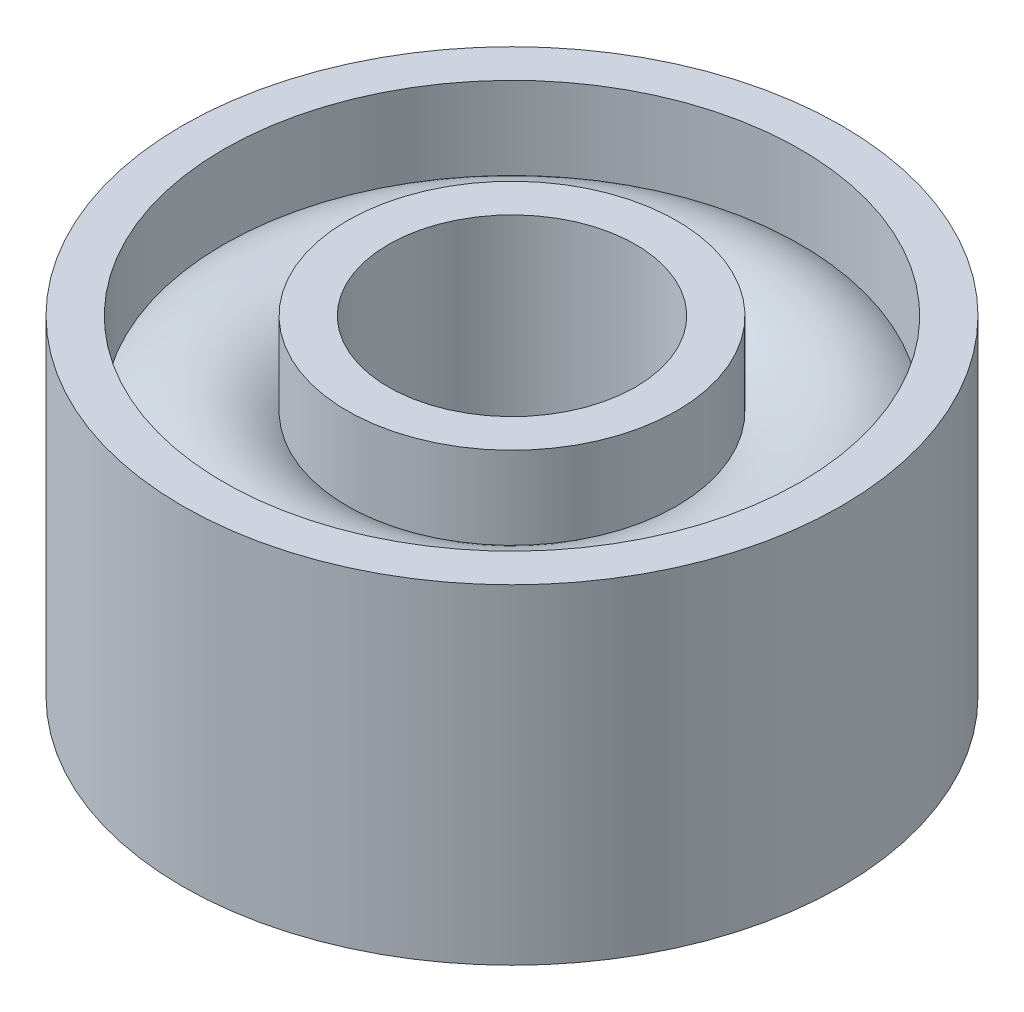
ISO-10303-21;
HEADER;
FILE_DESCRIPTION(('STEP AP214'),'2;1');
FILE_NAME('part.step','',(''),(''),'','','');
FILE_SCHEMA(('AUTOMOTIVE_DESIGN { 1 0 10303 214 1 1 1 1 }'));
ENDSEC;
DATA;
#1=APPLICATION_CONTEXT('core data for automotive mechanical design processes');
#2=APPLICATION_PROTOCOL_DEFINITION('international standard','automotive_design',2000,#1);
#3=PRODUCT_CONTEXT('',#1,'mechanical');
#4=PRODUCT('Part','Part','',(#3));
#5=PRODUCT_RELATED_PRODUCT_CATEGORY('part','',(#4));
#6=PRODUCT_DEFINITION_FORMATION('','',#4);
#7=PRODUCT_DEFINITION_CONTEXT('part definition',#1,'design');
#8=PRODUCT_DEFINITION('design','',#6,#7);
#9=PRODUCT_DEFINITION_SHAPE('','',#8);
#10=(LENGTH_UNIT() NAMED_UNIT(*) SI_UNIT(.MILLI.,.METRE.));
#11=(NAMED_UNIT(*) PLANE_ANGLE_UNIT() SI_UNIT($,.RADIAN.));
#12=(NAMED_UNIT(*) SI_UNIT($,.STERADIAN.) SOLID_ANGLE_UNIT());
#13=UNCERTAINTY_MEASURE_WITH_UNIT(LENGTH_MEASURE(1.E-05),#10,'distance_accuracy_value','');
#14=(GEOMETRIC_REPRESENTATION_CONTEXT(3) GLOBAL_UNCERTAINTY_ASSIGNED_CONTEXT((#13)) GLOBAL_UNIT_ASSIGNED_CONTEXT((#10,
#11,#12)) REPRESENTATION_CONTEXT('',''));
#15=CARTESIAN_POINT('',(0.,0.,0.));
#16=DIRECTION('',(0.,0.,1.));
#17=DIRECTION('',(1.,0.,0.));
#18=AXIS2_PLACEMENT_3D('',#15,#16,#17);
#19=CARTESIAN_POINT('',(1.5,2.,0.));
#20=DIRECTION('',(0.,-1.,0.));
#21=DIRECTION('',(1.,0.,0.));
#22=AXIS2_PLACEMENT_3D('',#19,#20,#21);
#23=PLANE('',#22);
#24=CARTESIAN_POINT('',(0.,2.,0.));
#25=DIRECTION('',(0.,1.,0.));
#26=DIRECTION('',(-1.,0.,0.));
#27=AXIS2_PLACEMENT_3D('',#24,#25,#26);
#28=CIRCLE('',#27,1.5);
#29=CARTESIAN_POINT('',(-1.5,2.,0.));
#30=VERTEX_POINT('',#29);
#31=EDGE_CURVE('E94',#30,#30,#28,.T.);
#32=ORIENTED_EDGE('',*,*,#31,.F.);
#33=EDGE_LOOP('',(#32));
#34=FACE_BOUND('',#33,.T.);
#35=CARTESIAN_POINT('',(0.,2.,0.));
#36=DIRECTION('',(0.,1.,0.));
#37=DIRECTION('',(-1.,0.,0.));
#38=AXIS2_PLACEMENT_3D('',#35,#36,#37);
#39=CIRCLE('',#38,2.);
#40=CARTESIAN_POINT('',(-2.,2.,0.));
#41=VERTEX_POINT('',#40);
#42=EDGE_CURVE('E10',#41,#41,#39,.T.);
#43=ORIENTED_EDGE('',*,*,#42,.T.);
#44=EDGE_LOOP('',(#43));
#45=FACE_BOUND('',#44,.T.);
#46=ADVANCED_FACE('F43',(#34,#45),#23,.F.);
#47=CARTESIAN_POINT('',(0.,1.33821248436376,0.));
#48=DIRECTION('',(0.,1.,0.));
#49=DIRECTION('',(-1.,0.,0.));
#50=AXIS2_PLACEMENT_3D('',#47,#48,#49);
#51=CYLINDRICAL_SURFACE('',#50,2.);
#52=ORIENTED_EDGE('',*,*,#42,.F.);
#53=EDGE_LOOP('',(#52));
#54=FACE_BOUND('',#53,.T.);
#55=CARTESIAN_POINT('',(0.,1.,0.));
#56=DIRECTION('',(0.,1.,0.));
#57=DIRECTION('',(-1.,0.,0.));
#58=AXIS2_PLACEMENT_3D('',#55,#56,#57);
#59=CIRCLE('',#58,2.);
#60=CARTESIAN_POINT('',(-2.,0.999999999999999,0.));
#61=VERTEX_POINT('',#60);
#62=EDGE_CURVE('E50',#61,#61,#59,.T.);
#63=ORIENTED_EDGE('',*,*,#62,.T.);
#64=EDGE_LOOP('',(#63));
#65=FACE_BOUND('',#64,.T.);
#66=ADVANCED_FACE('F102',(#54,#65),#51,.T.);
#67=CARTESIAN_POINT('',(0.,0.,0.));
#68=DIRECTION('',(0.,1.,0.));
#69=DIRECTION('',(-1.,0.,0.));
#70=AXIS2_PLACEMENT_3D('',#67,#68,#69);
#71=TOROIDAL_SURFACE('',#70,2.75,1.25);
#72=ORIENTED_EDGE('',*,*,#62,.F.);
#73=EDGE_LOOP('',(#72));
#74=FACE_BOUND('',#73,.T.);
#75=CARTESIAN_POINT('',(0.,0.999999999999999,0.));
#76=DIRECTION('',(0.,1.,0.));
#77=DIRECTION('',(-1.,0.,0.));
#78=AXIS2_PLACEMENT_3D('',#75,#76,#77);
#79=CIRCLE('',#78,3.5);
#80=CARTESIAN_POINT('',(-3.5,0.999999999999999,0.));
#81=VERTEX_POINT('',#80);
#82=EDGE_CURVE('E55',#81,#81,#79,.T.);
#83=ORIENTED_EDGE('',*,*,#82,.T.);
#84=EDGE_LOOP('',(#83));
#85=FACE_BOUND('',#84,.T.);
#86=ADVANCED_FACE('F106',(#74,#85),#71,.T.);
#87=CARTESIAN_POINT('',(0.,1.33821248436376,0.));
#88=DIRECTION('',(0.,1.,0.));
#89=DIRECTION('',(-1.,0.,0.));
#90=AXIS2_PLACEMENT_3D('',#87,#88,#89);
#91=CYLINDRICAL_SURFACE('',#90,3.5);
#92=ORIENTED_EDGE('',*,*,#82,.F.);
#93=EDGE_LOOP('',(#92));
#94=FACE_BOUND('',#93,.T.);
#95=CARTESIAN_POINT('',(0.,2.,0.));
#96=DIRECTION('',(0.,1.,0.));
#97=DIRECTION('',(-1.,0.,0.));
#98=AXIS2_PLACEMENT_3D('',#95,#96,#97);
#99=CIRCLE('',#98,3.5);
#100=CARTESIAN_POINT('',(-3.5,2.,0.));
#101=VERTEX_POINT('',#100);
#102=EDGE_CURVE('E60',#101,#101,#99,.T.);
#103=ORIENTED_EDGE('',*,*,#102,.T.);
#104=EDGE_LOOP('',(#103));
#105=FACE_BOUND('',#104,.T.);
#106=ADVANCED_FACE('F111',(#94,#105),#91,.F.);
#107=CARTESIAN_POINT('',(3.5,2.,0.));
#108=DIRECTION('',(0.,-1.,0.));
#109=DIRECTION('',(1.,0.,0.));
#110=AXIS2_PLACEMENT_3D('',#107,#108,#109);
#111=PLANE('',#110);
#112=ORIENTED_EDGE('',*,*,#102,.F.);
#113=EDGE_LOOP('',(#112));
#114=FACE_BOUND('',#113,.T.);
#115=CARTESIAN_POINT('',(0.,2.,0.));
#116=DIRECTION('',(0.,1.,0.));
#117=DIRECTION('',(-1.,0.,0.));
#118=AXIS2_PLACEMENT_3D('',#115,#116,#117);
#119=CIRCLE('',#118,4.);
#120=CARTESIAN_POINT('',(-4.,2.,0.));
#121=VERTEX_POINT('',#120);
#122=EDGE_CURVE('E66',#121,#121,#119,.T.);
#123=ORIENTED_EDGE('',*,*,#122,.T.);
#124=EDGE_LOOP('',(#123));
#125=FACE_BOUND('',#124,.T.);
#126=ADVANCED_FACE('F117',(#114,#125),#111,.F.);
#127=CARTESIAN_POINT('',(0.,1.33821248436376,0.));
#128=DIRECTION('',(0.,1.,0.));
#129=DIRECTION('',(-1.,0.,0.));
#130=AXIS2_PLACEMENT_3D('',#127,#128,#129);
#131=CYLINDRICAL_SURFACE('',#130,4.);
#132=ORIENTED_EDGE('',*,*,#122,.F.);
#133=EDGE_LOOP('',(#132));
#134=FACE_BOUND('',#133,.T.);
#135=CARTESIAN_POINT('',(0.,-2.,0.));
#136=DIRECTION('',(0.,1.,0.));
#137=DIRECTION('',(-1.,0.,0.));
#138=AXIS2_PLACEMENT_3D('',#135,#136,#137);
#139=CIRCLE('',#138,4.);
#140=CARTESIAN_POINT('',(-4.,-2.,0.));
#141=VERTEX_POINT('',#140);
#142=EDGE_CURVE('E70',#141,#141,#139,.T.);
#143=ORIENTED_EDGE('',*,*,#142,.T.);
#144=EDGE_LOOP('',(#143));
#145=FACE_BOUND('',#144,.T.);
#146=ADVANCED_FACE('F121',(#134,#145),#131,.T.);
#147=CARTESIAN_POINT('',(4.,-2.,0.));
#148=DIRECTION('',(0.,1.,0.));
#149=DIRECTION('',(-1.,0.,0.));
#150=AXIS2_PLACEMENT_3D('',#147,#148,#149);
#151=PLANE('',#150);
#152=ORIENTED_EDGE('',*,*,#142,.F.);
#153=EDGE_LOOP('',(#152));
#154=FACE_BOUND('',#153,.T.);
#155=CARTESIAN_POINT('',(0.,-2.,0.));
#156=DIRECTION('',(0.,1.,0.));
#157=DIRECTION('',(-1.,0.,0.));
#158=AXIS2_PLACEMENT_3D('',#155,#156,#157);
#159=CIRCLE('',#158,3.5);
#160=CARTESIAN_POINT('',(-3.5,-2.,0.));
#161=VERTEX_POINT('',#160);
#162=EDGE_CURVE('E74',#161,#161,#159,.T.);
#163=ORIENTED_EDGE('',*,*,#162,.T.);
#164=EDGE_LOOP('',(#163));
#165=FACE_BOUND('',#164,.T.);
#166=ADVANCED_FACE('F125',(#154,#165),#151,.F.);
#167=CARTESIAN_POINT('',(0.,1.33821248436376,0.));
#168=DIRECTION('',(0.,1.,0.));
#169=DIRECTION('',(-1.,0.,0.));
#170=AXIS2_PLACEMENT_3D('',#167,#168,#169);
#171=CYLINDRICAL_SURFACE('',#170,3.5);
#172=ORIENTED_EDGE('',*,*,#162,.F.);
#173=EDGE_LOOP('',(#172));
#174=FACE_BOUND('',#173,.T.);
#175=CARTESIAN_POINT('',(0.,-1.,0.));
#176=DIRECTION('',(0.,1.,0.));
#177=DIRECTION('',(-1.,0.,0.));
#178=AXIS2_PLACEMENT_3D('',#175,#176,#177);
#179=CIRCLE('',#178,3.5);
#180=CARTESIAN_POINT('',(-3.5,-1.,0.));
#181=VERTEX_POINT('',#180);
#182=EDGE_CURVE('E78',#181,#181,#179,.T.);
#183=ORIENTED_EDGE('',*,*,#182,.T.);
#184=EDGE_LOOP('',(#183));
#185=FACE_BOUND('',#184,.T.);
#186=ADVANCED_FACE('F129',(#174,#185),#171,.F.);
#187=CARTESIAN_POINT('',(0.,0.,0.));
#188=DIRECTION('',(0.,1.,0.));
#189=DIRECTION('',(-1.,0.,0.));
#190=AXIS2_PLACEMENT_3D('',#187,#188,#189);
#191=TOROIDAL_SURFACE('',#190,2.75,1.25);
#192=ORIENTED_EDGE('',*,*,#182,.F.);
#193=EDGE_LOOP('',(#192));
#194=FACE_BOUND('',#193,.T.);
#195=CARTESIAN_POINT('',(0.,-1.,0.));
#196=DIRECTION('',(0.,1.,0.));
#197=DIRECTION('',(-1.,0.,0.));
#198=AXIS2_PLACEMENT_3D('',#195,#196,#197);
#199=CIRCLE('',#198,2.);
#200=CARTESIAN_POINT('',(-2.,-1.,0.));
#201=VERTEX_POINT('',#200);
#202=EDGE_CURVE('E82',#201,#201,#199,.T.);
#203=ORIENTED_EDGE('',*,*,#202,.T.);
#204=EDGE_LOOP('',(#203));
#205=FACE_BOUND('',#204,.T.);
#206=ADVANCED_FACE('F133',(#194,#205),#191,.T.);
#207=CARTESIAN_POINT('',(0.,1.33821248436376,0.));
#208=DIRECTION('',(0.,1.,0.));
#209=DIRECTION('',(-1.,0.,0.));
#210=AXIS2_PLACEMENT_3D('',#207,#208,#209);
#211=CYLINDRICAL_SURFACE('',#210,2.);
#212=ORIENTED_EDGE('',*,*,#202,.F.);
#213=EDGE_LOOP('',(#212));
#214=FACE_BOUND('',#213,.T.);
#215=CARTESIAN_POINT('',(0.,-2.,0.));
#216=DIRECTION('',(0.,1.,0.));
#217=DIRECTION('',(-1.,0.,0.));
#218=AXIS2_PLACEMENT_3D('',#215,#216,#217);
#219=CIRCLE('',#218,2.);
#220=CARTESIAN_POINT('',(-2.,-2.,0.));
#221=VERTEX_POINT('',#220);
#222=EDGE_CURVE('E86',#221,#221,#219,.T.);
#223=ORIENTED_EDGE('',*,*,#222,.T.);
#224=EDGE_LOOP('',(#223));
#225=FACE_BOUND('',#224,.T.);
#226=ADVANCED_FACE('F137',(#214,#225),#211,.T.);
#227=CARTESIAN_POINT('',(1.5,-2.,0.));
#228=DIRECTION('',(0.,1.,0.));
#229=DIRECTION('',(-1.,0.,0.));
#230=AXIS2_PLACEMENT_3D('',#227,#228,#229);
#231=PLANE('',#230);
#232=ORIENTED_EDGE('',*,*,#222,.F.);
#233=EDGE_LOOP('',(#232));
#234=FACE_BOUND('',#233,.T.);
#235=CARTESIAN_POINT('',(0.,-2.,0.));
#236=DIRECTION('',(0.,1.,0.));
#237=DIRECTION('',(-1.,0.,0.));
#238=AXIS2_PLACEMENT_3D('',#235,#236,#237);
#239=CIRCLE('',#238,1.5);
#240=CARTESIAN_POINT('',(-1.5,-2.,0.));
#241=VERTEX_POINT('',#240);
#242=EDGE_CURVE('E90',#241,#241,#239,.T.);
#243=ORIENTED_EDGE('',*,*,#242,.T.);
#244=EDGE_LOOP('',(#243));
#245=FACE_BOUND('',#244,.T.);
#246=ADVANCED_FACE('F141',(#234,#245),#231,.F.);
#247=CARTESIAN_POINT('',(0.,1.33821248436376,0.));
#248=DIRECTION('',(0.,1.,0.));
#249=DIRECTION('',(-1.,0.,0.));
#250=AXIS2_PLACEMENT_3D('',#247,#248,#249);
#251=CYLINDRICAL_SURFACE('',#250,1.5);
#252=ORIENTED_EDGE('',*,*,#242,.F.);
#253=EDGE_LOOP('',(#252));
#254=FACE_BOUND('',#253,.T.);
#255=ORIENTED_EDGE('',*,*,#31,.T.);
#256=EDGE_LOOP('',(#255));
#257=FACE_BOUND('',#256,.T.);
#258=ADVANCED_FACE('F99',(#254,#257),#251,.F.);
#259=CLOSED_SHELL('',(#46,#66,#86,#106,#126,#146,#166,#186,#206,#226,#246,#258));
#260=MANIFOLD_SOLID_BREP('B2',#259);
#261=ADVANCED_BREP_SHAPE_REPRESENTATION('',(#18,#260),#14);
#262=SHAPE_DEFINITION_REPRESENTATION(#9,#261);
ENDSEC;
END-ISO-10303-21;
